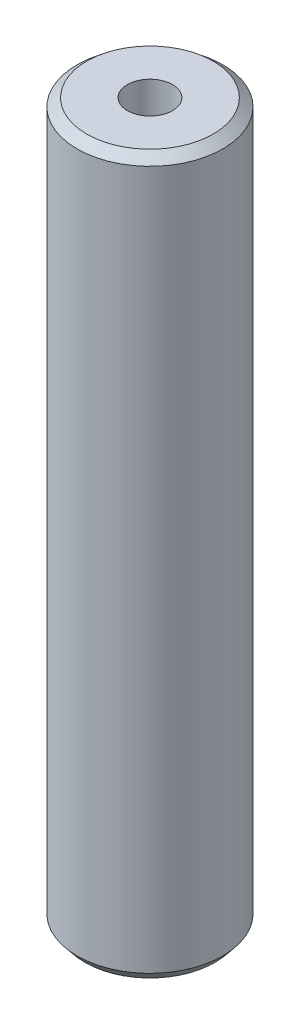
ISO-10303-21;
HEADER;
FILE_DESCRIPTION(('STEP AP214'),'2;1');
FILE_NAME('part.step','',(''),(''),'','','');
FILE_SCHEMA(('AUTOMOTIVE_DESIGN { 1 0 10303 214 1 1 1 1 }'));
ENDSEC;
DATA;
#1=APPLICATION_CONTEXT('core data for automotive mechanical design processes');
#2=APPLICATION_PROTOCOL_DEFINITION('international standard','automotive_design',2000,#1);
#3=PRODUCT_CONTEXT('',#1,'mechanical');
#4=PRODUCT('Part','Part','',(#3));
#5=PRODUCT_RELATED_PRODUCT_CATEGORY('part','',(#4));
#6=PRODUCT_DEFINITION_FORMATION('','',#4);
#7=PRODUCT_DEFINITION_CONTEXT('part definition',#1,'design');
#8=PRODUCT_DEFINITION('design','',#6,#7);
#9=PRODUCT_DEFINITION_SHAPE('','',#8);
#10=(LENGTH_UNIT() NAMED_UNIT(*) SI_UNIT(.MILLI.,.METRE.));
#11=(NAMED_UNIT(*) PLANE_ANGLE_UNIT() SI_UNIT($,.RADIAN.));
#12=(NAMED_UNIT(*) SI_UNIT($,.STERADIAN.) SOLID_ANGLE_UNIT());
#13=UNCERTAINTY_MEASURE_WITH_UNIT(LENGTH_MEASURE(1.E-05),#10,'distance_accuracy_value','');
#14=(GEOMETRIC_REPRESENTATION_CONTEXT(3) GLOBAL_UNCERTAINTY_ASSIGNED_CONTEXT((#13)) GLOBAL_UNIT_ASSIGNED_CONTEXT((#10,
#11,#12)) REPRESENTATION_CONTEXT('',''));
#15=CARTESIAN_POINT('',(0.,0.,0.));
#16=DIRECTION('',(0.,0.,1.));
#17=DIRECTION('',(1.,0.,0.));
#18=AXIS2_PLACEMENT_3D('',#15,#16,#17);
#19=CARTESIAN_POINT('',(0.,393.151625043692,0.));
#20=DIRECTION('',(0.,-1.,0.));
#21=DIRECTION('',(0.,0.,-1.));
#22=AXIS2_PLACEMENT_3D('',#19,#20,#21);
#23=CYLINDRICAL_SURFACE('',#22,40.);
#24=CARTESIAN_POINT('',(0.,388.778028135706,0.));
#25=DIRECTION('',(0.,1.,0.));
#26=DIRECTION('',(0.,0.,1.));
#27=AXIS2_PLACEMENT_3D('',#24,#25,#26);
#28=CIRCLE('',#27,40.);
#29=CARTESIAN_POINT('',(0.,388.778028135706,40.));
#30=VERTEX_POINT('',#29);
#31=EDGE_CURVE('E50',#30,#30,#28,.F.);
#32=ORIENTED_EDGE('',*,*,#31,.T.);
#33=EDGE_LOOP('',(#32));
#34=FACE_BOUND('',#33,.T.);
#35=CARTESIAN_POINT('',(0.,5.31121766339276,0.));
#36=DIRECTION('',(0.,1.,0.));
#37=DIRECTION('',(0.,0.,1.));
#38=AXIS2_PLACEMENT_3D('',#35,#36,#37);
#39=CIRCLE('',#38,40.);
#40=CARTESIAN_POINT('',(0.,5.31121766339276,40.));
#41=VERTEX_POINT('',#40);
#42=EDGE_CURVE('E51',#41,#41,#39,.T.);
#43=ORIENTED_EDGE('',*,*,#42,.T.);
#44=EDGE_LOOP('',(#43));
#45=FACE_BOUND('',#44,.T.);
#46=ADVANCED_FACE('F39',(#34,#45),#23,.T.);
#47=CARTESIAN_POINT('',(0.,393.151625043692,0.));
#48=DIRECTION('',(0.,1.,0.));
#49=DIRECTION('',(0.,0.,1.));
#50=AXIS2_PLACEMENT_3D('',#47,#48,#49);
#51=PLANE('',#50);
#52=CARTESIAN_POINT('',(0.,393.151625043692,0.));
#53=DIRECTION('',(0.,1.,0.));
#54=DIRECTION('',(0.,0.,1.));
#55=AXIS2_PLACEMENT_3D('',#52,#53,#54);
#56=CIRCLE('',#55,34.6887823366072);
#57=CARTESIAN_POINT('',(0.,393.151625043692,34.6887823366072));
#58=VERTEX_POINT('',#57);
#59=EDGE_CURVE('E54',#58,#58,#56,.T.);
#60=ORIENTED_EDGE('',*,*,#59,.T.);
#61=EDGE_LOOP('',(#60));
#62=FACE_BOUND('',#61,.T.);
#63=CARTESIAN_POINT('',(0.,393.151625043692,0.));
#64=DIRECTION('',(0.,1.,0.));
#65=DIRECTION('',(0.,0.,1.));
#66=AXIS2_PLACEMENT_3D('',#63,#64,#65);
#67=CIRCLE('',#66,12.3961873573629);
#68=CARTESIAN_POINT('',(0.,393.151625043692,12.3961873573629));
#69=VERTEX_POINT('',#68);
#70=EDGE_CURVE('E58',#69,#69,#67,.T.);
#71=ORIENTED_EDGE('',*,*,#70,.F.);
#72=EDGE_LOOP('',(#71));
#73=FACE_BOUND('',#72,.T.);
#74=ADVANCED_FACE('F69',(#62,#73),#51,.T.);
#75=CARTESIAN_POINT('',(0.,0.,0.));
#76=DIRECTION('',(0.,1.,0.));
#77=DIRECTION('',(0.,0.,1.));
#78=AXIS2_PLACEMENT_3D('',#75,#76,#77);
#79=PLANE('',#78);
#80=CARTESIAN_POINT('',(0.,0.,0.));
#81=DIRECTION('',(0.,1.,0.));
#82=DIRECTION('',(0.,0.,1.));
#83=AXIS2_PLACEMENT_3D('',#80,#81,#82);
#84=CIRCLE('',#83,35.6264030920143);
#85=CARTESIAN_POINT('',(0.,0.,35.6264030920143));
#86=VERTEX_POINT('',#85);
#87=EDGE_CURVE('E10',#86,#86,#84,.F.);
#88=ORIENTED_EDGE('',*,*,#87,.T.);
#89=EDGE_LOOP('',(#88));
#90=FACE_BOUND('',#89,.T.);
#91=CARTESIAN_POINT('',(0.,0.,0.));
#92=DIRECTION('',(0.,1.,0.));
#93=DIRECTION('',(0.,0.,1.));
#94=AXIS2_PLACEMENT_3D('',#91,#92,#93);
#95=CIRCLE('',#94,12.3961873573629);
#96=CARTESIAN_POINT('',(0.,0.,12.3961873573629));
#97=VERTEX_POINT('',#96);
#98=EDGE_CURVE('E63',#97,#97,#95,.T.);
#99=ORIENTED_EDGE('',*,*,#98,.T.);
#100=EDGE_LOOP('',(#99));
#101=FACE_BOUND('',#100,.T.);
#102=ADVANCED_FACE('F75',(#90,#101),#79,.F.);
#103=CARTESIAN_POINT('',(0.,393.151625043692,0.));
#104=DIRECTION('',(0.,-1.,0.));
#105=DIRECTION('',(0.,0.,-1.));
#106=AXIS2_PLACEMENT_3D('',#103,#104,#105);
#107=CYLINDRICAL_SURFACE('',#106,12.3961873573629);
#108=ORIENTED_EDGE('',*,*,#70,.T.);
#109=EDGE_LOOP('',(#108));
#110=FACE_BOUND('',#109,.T.);
#111=ORIENTED_EDGE('',*,*,#98,.F.);
#112=EDGE_LOOP('',(#111));
#113=FACE_BOUND('',#112,.T.);
#114=ADVANCED_FACE('F70',(#110,#113),#107,.F.);
#115=CARTESIAN_POINT('',(0.,393.151625043692,0.));
#116=DIRECTION('',(0.,-1.,0.));
#117=DIRECTION('',(0.,0.,-1.));
#118=AXIS2_PLACEMENT_3D('',#115,#116,#117);
#119=CONICAL_SURFACE('',#118,34.6887823366072,0.881910876083871);
#120=ORIENTED_EDGE('',*,*,#31,.F.);
#121=EDGE_LOOP('',(#120));
#122=FACE_BOUND('',#121,.T.);
#123=ORIENTED_EDGE('',*,*,#59,.F.);
#124=EDGE_LOOP('',(#123));
#125=FACE_BOUND('',#124,.T.);
#126=ADVANCED_FACE('F81',(#122,#125),#119,.T.);
#127=CARTESIAN_POINT('',(0.,5.31121766339276,0.));
#128=DIRECTION('',(0.,1.,0.));
#129=DIRECTION('',(0.,0.,1.));
#130=AXIS2_PLACEMENT_3D('',#127,#128,#129);
#131=CONICAL_SURFACE('',#130,40.,0.688885450711023);
#132=CARTESIAN_POINT('',(0.,0.,35.6264030920143));
#133=CARTESIAN_POINT('',(0.,0.055325183993673,35.6719613931391));
#134=CARTESIAN_POINT('',(0.,0.110650367987348,35.717519694264));
#135=CARTESIAN_POINT('',(0.,0.221300735974698,35.8086362965137));
#136=CARTESIAN_POINT('',(0.,0.276625919968373,35.8541945976385));
#137=CARTESIAN_POINT('',(0.,0.387276287955722,35.9453111998882));
#138=CARTESIAN_POINT('',(0.,0.442601471949396,35.9908695010131));
#139=CARTESIAN_POINT('',(0.,0.553251839936745,36.0819861032628));
#140=CARTESIAN_POINT('',(0.,0.60857702393042,36.1275444043876));
#141=CARTESIAN_POINT('',(0.,0.71922739191777,36.2186610066373));
#142=CARTESIAN_POINT('',(0.,0.774552575911445,36.2642193077622));
#143=CARTESIAN_POINT('',(0.,0.885202943898794,36.3553359100119));
#144=CARTESIAN_POINT('',(0.,0.940528127892467,36.4008942111367));
#145=CARTESIAN_POINT('',(0.,1.05117849587982,36.4920108133864));
#146=CARTESIAN_POINT('',(0.,1.10650367987349,36.5375691145113));
#147=CARTESIAN_POINT('',(0.,1.21715404786084,36.628685716761));
#148=CARTESIAN_POINT('',(0.,1.27247923185452,36.6742440178858));
#149=CARTESIAN_POINT('',(0.,1.38312959984187,36.7653606201355));
#150=CARTESIAN_POINT('',(0.,1.43845478383554,36.8109189212604));
#151=CARTESIAN_POINT('',(0.,1.54910515182289,36.9020355235101));
#152=CARTESIAN_POINT('',(0.,1.60443033581656,36.947593824635));
#153=CARTESIAN_POINT('',(0.,1.71508070380391,37.0387104268847));
#154=CARTESIAN_POINT('',(0.,1.77040588779759,37.0842687280095));
#155=CARTESIAN_POINT('',(0.,1.88105625578494,37.1753853302592));
#156=CARTESIAN_POINT('',(0.,1.93638143977861,37.2209436313841));
#157=CARTESIAN_POINT('',(0.,2.04703180776596,37.3120602336338));
#158=CARTESIAN_POINT('',(0.,2.10235699175964,37.3576185347586));
#159=CARTESIAN_POINT('',(0.,2.21300735974698,37.4487351370083));
#160=CARTESIAN_POINT('',(0.,2.26833254374066,37.4942934381332));
#161=CARTESIAN_POINT('',(0.,2.37898291172801,37.5854100403829));
#162=CARTESIAN_POINT('',(0.,2.43430809572168,37.6309683415077));
#163=CARTESIAN_POINT('',(0.,2.54495846370903,37.7220849437574));
#164=CARTESIAN_POINT('',(0.,2.60028364770271,37.7676432448823));
#165=CARTESIAN_POINT('',(0.,2.71093401569006,37.858759847132));
#166=CARTESIAN_POINT('',(0.,2.76625919968373,37.9043181482568));
#167=CARTESIAN_POINT('',(0.,2.87690956767108,37.9954347505065));
#168=CARTESIAN_POINT('',(0.,2.93223475166475,38.0409930516314));
#169=CARTESIAN_POINT('',(0.,3.0428851196521,38.1321096538811));
#170=CARTESIAN_POINT('',(0.,3.09821030364578,38.1776679550059));
#171=CARTESIAN_POINT('',(0.,3.20886067163313,38.2687845572556));
#172=CARTESIAN_POINT('',(0.,3.2641858556268,38.3143428583805));
#173=CARTESIAN_POINT('',(0.,3.37483622361415,38.4054594606302));
#174=CARTESIAN_POINT('',(0.,3.43016140760783,38.4510177617551));
#175=CARTESIAN_POINT('',(0.,3.54081177559518,38.5421343640047));
#176=CARTESIAN_POINT('',(0.,3.59613695958885,38.5876926651296));
#177=CARTESIAN_POINT('',(0.,3.7067873275762,38.6788092673793));
#178=CARTESIAN_POINT('',(0.,3.76211251156987,38.7243675685042));
#179=CARTESIAN_POINT('',(0.,3.87276287955722,38.8154841707539));
#180=CARTESIAN_POINT('',(0.,3.9280880635509,38.8610424718787));
#181=CARTESIAN_POINT('',(0.,4.03873843153825,38.9521590741284));
#182=CARTESIAN_POINT('',(0.,4.09406361553192,38.9977173752533));
#183=CARTESIAN_POINT('',(0.,4.20471398351927,39.088833977503));
#184=CARTESIAN_POINT('',(0.,4.26003916751294,39.1343922786278));
#185=CARTESIAN_POINT('',(0.,4.37068953550029,39.2255088808775));
#186=CARTESIAN_POINT('',(0.,4.42601471949397,39.2710671820024));
#187=CARTESIAN_POINT('',(0.,4.53666508748132,39.3621837842521));
#188=CARTESIAN_POINT('',(0.,4.59199027147499,39.4077420853769));
#189=CARTESIAN_POINT('',(0.,4.70264063946234,39.4988586876266));
#190=CARTESIAN_POINT('',(0.,4.75796582345602,39.5444169887515));
#191=CARTESIAN_POINT('',(0.,4.86861619144337,39.6355335910012));
#192=CARTESIAN_POINT('',(0.,4.92394137543704,39.681091892126));
#193=CARTESIAN_POINT('',(0.,5.03459174342439,39.7722084943757));
#194=CARTESIAN_POINT('',(0.,5.08991692741806,39.8177667955006));
#195=CARTESIAN_POINT('',(0.,5.20056729540541,39.9088833977503));
#196=CARTESIAN_POINT('',(0.,5.25589247939909,39.9544416988752));
#197=CARTESIAN_POINT('',(0.,5.31121766339276,40.));
#198=B_SPLINE_CURVE_WITH_KNOTS('',3,(#132,#133,#134,#135,#136,#137,#138,#139,#140,#141,#142,
#143,#144,#145,#146,#147,#148,#149,#150,#151,#152,#153,#154,#155,#156,#157,#158,#159,#160,#161,
#162,#163,#164,#165,#166,#167,#168,#169,#170,#171,#172,#173,#174,#175,#176,#177,#178,#179,#180,
#181,#182,#183,#184,#185,#186,#187,#188,#189,#190,#191,#192,#193,#194,#195,#196,#197),
.UNSPECIFIED.,.F.,.F.,(4,2,2,2,2,2,2,2,2,2,2,2,2,2,2,2,2,2,2,2,2,2,2,2,2,2,2,2,2,2,2,2,4),(0.,
0.215006774469663,0.430013548939327,0.645020323408995,0.860027097878658,1.07503387234832,
1.29004064681799,1.50504742128765,1.72005419575732,1.93506097022698,2.15006774469665,
2.36507451916631,2.58008129363598,2.79508806810564,3.01009484257531,3.22510161704497,
3.44010839151464,3.6551151659843,3.87012194045397,4.08512871492363,4.3001354893933,
4.51514226386296,4.73014903833263,4.94515581280229,5.16016258727196,5.37516936174162,
5.59017613621129,5.80518291068095,6.02018968515062,6.23519645962028,6.45020323408994,
6.66521000855961,6.88021678302927),.UNSPECIFIED.);
#199=EDGE_CURVE('BSEAM45',#86,#41,#198,.T.);
#200=ORIENTED_EDGE('',*,*,#87,.F.);
#201=ORIENTED_EDGE('',*,*,#42,.F.);
#202=ORIENTED_EDGE('',*,*,#199,.T.);
#203=ORIENTED_EDGE('',*,*,#199,.F.);
#204=EDGE_LOOP('',(#200,#202,#201,#203));
#205=FACE_BOUND('',#204,.T.);
#206=ADVANCED_FACE('F45',(#205),#131,.T.);
#207=CLOSED_SHELL('',(#46,#74,#102,#114,#126,#206));
#208=MANIFOLD_SOLID_BREP('B2',#207);
#209=ADVANCED_BREP_SHAPE_REPRESENTATION('',(#18,#208),#14);
#210=SHAPE_DEFINITION_REPRESENTATION(#9,#209);
ENDSEC;
END-ISO-10303-21;
